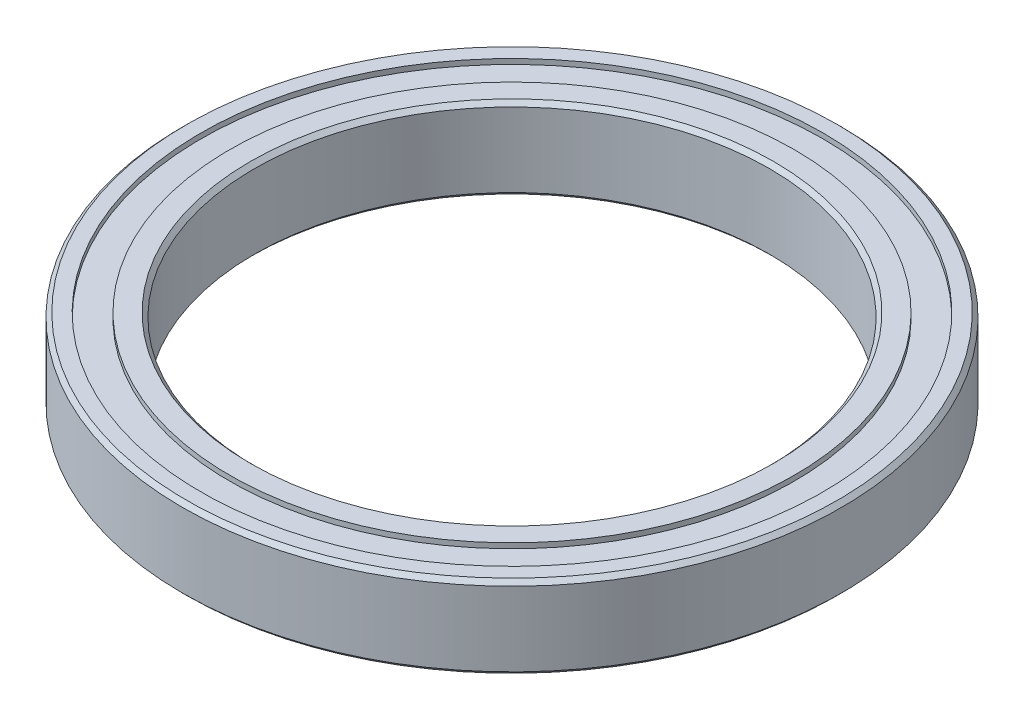
ISO-10303-21;
HEADER;
FILE_DESCRIPTION(('STEP AP214'),'2;1');
FILE_NAME('part.step','',(''),(''),'','','');
FILE_SCHEMA(('AUTOMOTIVE_DESIGN { 1 0 10303 214 1 1 1 1 }'));
ENDSEC;
DATA;
#1=APPLICATION_CONTEXT('core data for automotive mechanical design processes');
#2=APPLICATION_PROTOCOL_DEFINITION('international standard','automotive_design',2000,#1);
#3=PRODUCT_CONTEXT('',#1,'mechanical');
#4=PRODUCT('Part','Part','',(#3));
#5=PRODUCT_RELATED_PRODUCT_CATEGORY('part','',(#4));
#6=PRODUCT_DEFINITION_FORMATION('','',#4);
#7=PRODUCT_DEFINITION_CONTEXT('part definition',#1,'design');
#8=PRODUCT_DEFINITION('design','',#6,#7);
#9=PRODUCT_DEFINITION_SHAPE('','',#8);
#10=(LENGTH_UNIT() NAMED_UNIT(*) SI_UNIT(.MILLI.,.METRE.));
#11=(NAMED_UNIT(*) PLANE_ANGLE_UNIT() SI_UNIT($,.RADIAN.));
#12=(NAMED_UNIT(*) SI_UNIT($,.STERADIAN.) SOLID_ANGLE_UNIT());
#13=UNCERTAINTY_MEASURE_WITH_UNIT(LENGTH_MEASURE(1.E-05),#10,'distance_accuracy_value','');
#14=(GEOMETRIC_REPRESENTATION_CONTEXT(3) GLOBAL_UNCERTAINTY_ASSIGNED_CONTEXT((#13)) GLOBAL_UNIT_ASSIGNED_CONTEXT((#10,
#11,#12)) REPRESENTATION_CONTEXT('',''));
#15=CARTESIAN_POINT('',(0.,0.,0.));
#16=DIRECTION('',(0.,0.,1.));
#17=DIRECTION('',(1.,0.,0.));
#18=AXIS2_PLACEMENT_3D('',#15,#16,#17);
#19=CARTESIAN_POINT('',(0.,-2.,16.));
#20=DIRECTION('',(0.,1.,0.));
#21=DIRECTION('',(0.,0.,1.));
#22=AXIS2_PLACEMENT_3D('',#19,#20,#21);
#23=PLANE('',#22);
#24=CARTESIAN_POINT('',(0.,-2.,0.));
#25=DIRECTION('',(0.,1.,0.));
#26=DIRECTION('',(0.,0.,1.));
#27=AXIS2_PLACEMENT_3D('',#24,#25,#26);
#28=CIRCLE('',#27,15.8);
#29=CARTESIAN_POINT('',(0.,-2.,15.8));
#30=VERTEX_POINT('',#29);
#31=EDGE_CURVE('E10',#30,#30,#28,.F.);
#32=ORIENTED_EDGE('',*,*,#31,.T.);
#33=EDGE_LOOP('',(#32));
#34=FACE_BOUND('',#33,.T.);
#35=CARTESIAN_POINT('',(0.,-2.,0.));
#36=DIRECTION('',(0.,-1.,0.));
#37=DIRECTION('',(0.,0.,-1.));
#38=AXIS2_PLACEMENT_3D('',#35,#36,#37);
#39=CIRCLE('',#38,15.1);
#40=CARTESIAN_POINT('',(0.,-2.,-15.1));
#41=VERTEX_POINT('',#40);
#42=EDGE_CURVE('E69',#41,#41,#39,.T.);
#43=ORIENTED_EDGE('',*,*,#42,.F.);
#44=EDGE_LOOP('',(#43));
#45=FACE_BOUND('',#44,.T.);
#46=ADVANCED_FACE('F37',(#34,#45),#23,.F.);
#47=CARTESIAN_POINT('',(0.,-18.1229138650565,0.));
#48=DIRECTION('',(0.,-1.,0.));
#49=DIRECTION('',(0.,0.,-1.));
#50=AXIS2_PLACEMENT_3D('',#47,#48,#49);
#51=CYLINDRICAL_SURFACE('',#50,15.1);
#52=CARTESIAN_POINT('',(0.,-1.75,0.));
#53=DIRECTION('',(0.,-1.,0.));
#54=DIRECTION('',(0.,0.,-1.));
#55=AXIS2_PLACEMENT_3D('',#52,#53,#54);
#56=CIRCLE('',#55,15.1);
#57=CARTESIAN_POINT('',(0.,-1.75,-15.1));
#58=VERTEX_POINT('',#57);
#59=EDGE_CURVE('E72',#58,#58,#56,.T.);
#60=ORIENTED_EDGE('',*,*,#59,.F.);
#61=EDGE_LOOP('',(#60));
#62=FACE_BOUND('',#61,.T.);
#63=ORIENTED_EDGE('',*,*,#42,.T.);
#64=EDGE_LOOP('',(#63));
#65=FACE_BOUND('',#64,.T.);
#66=ADVANCED_FACE('F126',(#62,#65),#51,.F.);
#67=CARTESIAN_POINT('',(0.,-1.75,15.1));
#68=DIRECTION('',(0.,1.,0.));
#69=DIRECTION('',(0.,0.,1.));
#70=AXIS2_PLACEMENT_3D('',#67,#68,#69);
#71=PLANE('',#70);
#72=CARTESIAN_POINT('',(0.,-1.75,0.));
#73=DIRECTION('',(0.,-1.,0.));
#74=DIRECTION('',(0.,0.,-1.));
#75=AXIS2_PLACEMENT_3D('',#72,#73,#74);
#76=CIRCLE('',#75,13.7);
#77=CARTESIAN_POINT('',(0.,-1.75,-13.7));
#78=VERTEX_POINT('',#77);
#79=EDGE_CURVE('E75',#78,#78,#76,.T.);
#80=ORIENTED_EDGE('',*,*,#79,.F.);
#81=EDGE_LOOP('',(#80));
#82=FACE_BOUND('',#81,.T.);
#83=ORIENTED_EDGE('',*,*,#59,.T.);
#84=EDGE_LOOP('',(#83));
#85=FACE_BOUND('',#84,.T.);
#86=ADVANCED_FACE('F131',(#82,#85),#71,.F.);
#87=CARTESIAN_POINT('',(0.,-18.1229138650565,0.));
#88=DIRECTION('',(0.,-1.,0.));
#89=DIRECTION('',(0.,0.,-1.));
#90=AXIS2_PLACEMENT_3D('',#87,#88,#89);
#91=CYLINDRICAL_SURFACE('',#90,13.7);
#92=CARTESIAN_POINT('',(0.,-2.,0.));
#93=DIRECTION('',(0.,-1.,0.));
#94=DIRECTION('',(0.,0.,-1.));
#95=AXIS2_PLACEMENT_3D('',#92,#93,#94);
#96=CIRCLE('',#95,13.7);
#97=CARTESIAN_POINT('',(0.,-2.,-13.7));
#98=VERTEX_POINT('',#97);
#99=EDGE_CURVE('E78',#98,#98,#96,.T.);
#100=ORIENTED_EDGE('',*,*,#99,.F.);
#101=EDGE_LOOP('',(#100));
#102=FACE_BOUND('',#101,.T.);
#103=ORIENTED_EDGE('',*,*,#79,.T.);
#104=EDGE_LOOP('',(#103));
#105=FACE_BOUND('',#104,.T.);
#106=ADVANCED_FACE('F185',(#102,#105),#91,.T.);
#107=CARTESIAN_POINT('',(0.,-2.,13.7));
#108=DIRECTION('',(0.,1.,0.));
#109=DIRECTION('',(0.,0.,1.));
#110=AXIS2_PLACEMENT_3D('',#107,#108,#109);
#111=PLANE('',#110);
#112=CARTESIAN_POINT('',(0.,-2.,0.));
#113=DIRECTION('',(0.,1.,0.));
#114=DIRECTION('',(0.,0.,1.));
#115=AXIS2_PLACEMENT_3D('',#112,#113,#114);
#116=CIRCLE('',#115,12.7);
#117=CARTESIAN_POINT('',(0.,-2.,12.7));
#118=VERTEX_POINT('',#117);
#119=EDGE_CURVE('E57',#118,#118,#116,.T.);
#120=ORIENTED_EDGE('',*,*,#119,.T.);
#121=EDGE_LOOP('',(#120));
#122=FACE_BOUND('',#121,.T.);
#123=ORIENTED_EDGE('',*,*,#99,.T.);
#124=EDGE_LOOP('',(#123));
#125=FACE_BOUND('',#124,.T.);
#126=ADVANCED_FACE('F122',(#122,#125),#111,.F.);
#127=CARTESIAN_POINT('',(0.,-18.1229138650565,0.));
#128=DIRECTION('',(0.,-1.,0.));
#129=DIRECTION('',(0.,0.,-1.));
#130=AXIS2_PLACEMENT_3D('',#127,#128,#129);
#131=CYLINDRICAL_SURFACE('',#130,12.5);
#132=CARTESIAN_POINT('',(0.,1.8,0.));
#133=DIRECTION('',(0.,-1.,0.));
#134=DIRECTION('',(0.,0.,-1.));
#135=AXIS2_PLACEMENT_3D('',#132,#133,#134);
#136=CIRCLE('',#135,12.5);
#137=CARTESIAN_POINT('',(0.,1.8,-12.5));
#138=VERTEX_POINT('',#137);
#139=EDGE_CURVE('E60',#138,#138,#136,.F.);
#140=ORIENTED_EDGE('',*,*,#139,.T.);
#141=EDGE_LOOP('',(#140));
#142=FACE_BOUND('',#141,.T.);
#143=CARTESIAN_POINT('',(0.,-1.79999999999999,0.));
#144=DIRECTION('',(0.,1.,0.));
#145=DIRECTION('',(0.,0.,1.));
#146=AXIS2_PLACEMENT_3D('',#143,#144,#145);
#147=CIRCLE('',#146,12.5);
#148=CARTESIAN_POINT('',(0.,-1.79999999999999,12.5));
#149=VERTEX_POINT('',#148);
#150=EDGE_CURVE('E63',#149,#149,#147,.F.);
#151=ORIENTED_EDGE('',*,*,#150,.T.);
#152=EDGE_LOOP('',(#151));
#153=FACE_BOUND('',#152,.T.);
#154=ADVANCED_FACE('F116',(#142,#153),#131,.F.);
#155=CARTESIAN_POINT('',(0.,2.,13.7));
#156=DIRECTION('',(0.,-1.,0.));
#157=DIRECTION('',(0.,0.,-1.));
#158=AXIS2_PLACEMENT_3D('',#155,#156,#157);
#159=PLANE('',#158);
#160=CARTESIAN_POINT('',(0.,2.,0.));
#161=DIRECTION('',(0.,-1.,0.));
#162=DIRECTION('',(0.,0.,-1.));
#163=AXIS2_PLACEMENT_3D('',#160,#161,#162);
#164=CIRCLE('',#163,12.7);
#165=CARTESIAN_POINT('',(0.,2.,-12.7));
#166=VERTEX_POINT('',#165);
#167=EDGE_CURVE('E66',#166,#166,#164,.T.);
#168=ORIENTED_EDGE('',*,*,#167,.T.);
#169=EDGE_LOOP('',(#168));
#170=FACE_BOUND('',#169,.T.);
#171=CARTESIAN_POINT('',(0.,2.,0.));
#172=DIRECTION('',(0.,-1.,0.));
#173=DIRECTION('',(0.,0.,-1.));
#174=AXIS2_PLACEMENT_3D('',#171,#172,#173);
#175=CIRCLE('',#174,13.7);
#176=CARTESIAN_POINT('',(0.,2.,-13.7));
#177=VERTEX_POINT('',#176);
#178=EDGE_CURVE('E81',#177,#177,#175,.T.);
#179=ORIENTED_EDGE('',*,*,#178,.F.);
#180=EDGE_LOOP('',(#179));
#181=FACE_BOUND('',#180,.T.);
#182=ADVANCED_FACE('F111',(#170,#181),#159,.F.);
#183=CARTESIAN_POINT('',(0.,-18.1229138650565,0.));
#184=DIRECTION('',(0.,-1.,0.));
#185=DIRECTION('',(0.,0.,-1.));
#186=AXIS2_PLACEMENT_3D('',#183,#184,#185);
#187=CYLINDRICAL_SURFACE('',#186,13.7);
#188=CARTESIAN_POINT('',(0.,1.75,0.));
#189=DIRECTION('',(0.,-1.,0.));
#190=DIRECTION('',(0.,0.,-1.));
#191=AXIS2_PLACEMENT_3D('',#188,#189,#190);
#192=CIRCLE('',#191,13.7);
#193=CARTESIAN_POINT('',(0.,1.75,-13.7));
#194=VERTEX_POINT('',#193);
#195=EDGE_CURVE('E84',#194,#194,#192,.T.);
#196=ORIENTED_EDGE('',*,*,#195,.F.);
#197=EDGE_LOOP('',(#196));
#198=FACE_BOUND('',#197,.T.);
#199=ORIENTED_EDGE('',*,*,#178,.T.);
#200=EDGE_LOOP('',(#199));
#201=FACE_BOUND('',#200,.T.);
#202=ADVANCED_FACE('F105',(#198,#201),#187,.T.);
#203=CARTESIAN_POINT('',(0.,1.75,15.1));
#204=DIRECTION('',(0.,-1.,0.));
#205=DIRECTION('',(0.,0.,-1.));
#206=AXIS2_PLACEMENT_3D('',#203,#204,#205);
#207=PLANE('',#206);
#208=CARTESIAN_POINT('',(0.,1.75,0.));
#209=DIRECTION('',(0.,-1.,0.));
#210=DIRECTION('',(0.,0.,-1.));
#211=AXIS2_PLACEMENT_3D('',#208,#209,#210);
#212=CIRCLE('',#211,15.1);
#213=CARTESIAN_POINT('',(0.,1.75,-15.1));
#214=VERTEX_POINT('',#213);
#215=EDGE_CURVE('E87',#214,#214,#212,.T.);
#216=ORIENTED_EDGE('',*,*,#215,.F.);
#217=EDGE_LOOP('',(#216));
#218=FACE_BOUND('',#217,.T.);
#219=ORIENTED_EDGE('',*,*,#195,.T.);
#220=EDGE_LOOP('',(#219));
#221=FACE_BOUND('',#220,.T.);
#222=ADVANCED_FACE('F99',(#218,#221),#207,.F.);
#223=CARTESIAN_POINT('',(0.,-18.1229138650565,0.));
#224=DIRECTION('',(0.,-1.,0.));
#225=DIRECTION('',(0.,0.,-1.));
#226=AXIS2_PLACEMENT_3D('',#223,#224,#225);
#227=CYLINDRICAL_SURFACE('',#226,15.1);
#228=CARTESIAN_POINT('',(0.,2.,0.));
#229=DIRECTION('',(0.,-1.,0.));
#230=DIRECTION('',(0.,0.,-1.));
#231=AXIS2_PLACEMENT_3D('',#228,#229,#230);
#232=CIRCLE('',#231,15.1);
#233=CARTESIAN_POINT('',(0.,2.,-15.1));
#234=VERTEX_POINT('',#233);
#235=EDGE_CURVE('E90',#234,#234,#232,.T.);
#236=ORIENTED_EDGE('',*,*,#235,.F.);
#237=EDGE_LOOP('',(#236));
#238=FACE_BOUND('',#237,.T.);
#239=ORIENTED_EDGE('',*,*,#215,.T.);
#240=EDGE_LOOP('',(#239));
#241=FACE_BOUND('',#240,.T.);
#242=ADVANCED_FACE('F96',(#238,#241),#227,.F.);
#243=CARTESIAN_POINT('',(0.,2.,16.));
#244=DIRECTION('',(0.,-1.,0.));
#245=DIRECTION('',(0.,0.,-1.));
#246=AXIS2_PLACEMENT_3D('',#243,#244,#245);
#247=PLANE('',#246);
#248=CARTESIAN_POINT('',(0.,2.,0.));
#249=DIRECTION('',(0.,-1.,0.));
#250=DIRECTION('',(0.,0.,-1.));
#251=AXIS2_PLACEMENT_3D('',#248,#249,#250);
#252=CIRCLE('',#251,15.8);
#253=CARTESIAN_POINT('',(0.,2.,-15.8));
#254=VERTEX_POINT('',#253);
#255=EDGE_CURVE('E44',#254,#254,#252,.F.);
#256=ORIENTED_EDGE('',*,*,#255,.T.);
#257=EDGE_LOOP('',(#256));
#258=FACE_BOUND('',#257,.T.);
#259=ORIENTED_EDGE('',*,*,#235,.T.);
#260=EDGE_LOOP('',(#259));
#261=FACE_BOUND('',#260,.T.);
#262=ADVANCED_FACE('F94',(#258,#261),#247,.F.);
#263=CARTESIAN_POINT('',(0.,-18.1229138650565,0.));
#264=DIRECTION('',(0.,-1.,0.));
#265=DIRECTION('',(0.,0.,-1.));
#266=AXIS2_PLACEMENT_3D('',#263,#264,#265);
#267=CYLINDRICAL_SURFACE('',#266,16.);
#268=CARTESIAN_POINT('',(0.,1.80000000000001,0.));
#269=DIRECTION('',(0.,-1.,0.));
#270=DIRECTION('',(0.,0.,-1.));
#271=AXIS2_PLACEMENT_3D('',#268,#269,#270);
#272=CIRCLE('',#271,16.);
#273=CARTESIAN_POINT('',(0.,1.80000000000001,-16.));
#274=VERTEX_POINT('',#273);
#275=EDGE_CURVE('E48',#274,#274,#272,.T.);
#276=ORIENTED_EDGE('',*,*,#275,.T.);
#277=EDGE_LOOP('',(#276));
#278=FACE_BOUND('',#277,.T.);
#279=CARTESIAN_POINT('',(0.,-1.80000000000002,0.));
#280=DIRECTION('',(0.,1.,0.));
#281=DIRECTION('',(0.,0.,1.));
#282=AXIS2_PLACEMENT_3D('',#279,#280,#281);
#283=CIRCLE('',#282,16.);
#284=CARTESIAN_POINT('',(0.,-1.80000000000002,16.));
#285=VERTEX_POINT('',#284);
#286=EDGE_CURVE('E52',#285,#285,#283,.T.);
#287=ORIENTED_EDGE('',*,*,#286,.T.);
#288=EDGE_LOOP('',(#287));
#289=FACE_BOUND('',#288,.T.);
#290=ADVANCED_FACE('F141',(#278,#289),#267,.T.);
#291=CARTESIAN_POINT('',(0.,2.,0.));
#292=DIRECTION('',(0.,1.,0.));
#293=DIRECTION('',(0.,0.,1.));
#294=AXIS2_PLACEMENT_3D('',#291,#292,#293);
#295=CONICAL_SURFACE('',#294,12.7,0.785398163397448);
#296=ORIENTED_EDGE('',*,*,#139,.F.);
#297=EDGE_LOOP('',(#296));
#298=FACE_BOUND('',#297,.T.);
#299=ORIENTED_EDGE('',*,*,#167,.F.);
#300=EDGE_LOOP('',(#299));
#301=FACE_BOUND('',#300,.T.);
#302=ADVANCED_FACE('F137',(#298,#301),#295,.F.);
#303=CARTESIAN_POINT('',(0.,-1.79999999999999,0.));
#304=DIRECTION('',(0.,-1.,0.));
#305=DIRECTION('',(0.,0.,-1.));
#306=AXIS2_PLACEMENT_3D('',#303,#304,#305);
#307=CONICAL_SURFACE('',#306,12.5,0.785398163397453);
#308=ORIENTED_EDGE('',*,*,#119,.F.);
#309=EDGE_LOOP('',(#308));
#310=FACE_BOUND('',#309,.T.);
#311=ORIENTED_EDGE('',*,*,#150,.F.);
#312=EDGE_LOOP('',(#311));
#313=FACE_BOUND('',#312,.T.);
#314=ADVANCED_FACE('F140',(#310,#313),#307,.F.);
#315=CARTESIAN_POINT('',(0.,1.80000000000001,0.));
#316=DIRECTION('',(0.,-1.,0.));
#317=DIRECTION('',(0.,0.,-1.));
#318=AXIS2_PLACEMENT_3D('',#315,#316,#317);
#319=CONICAL_SURFACE('',#318,16.,0.785398163397448);
#320=ORIENTED_EDGE('',*,*,#255,.F.);
#321=EDGE_LOOP('',(#320));
#322=FACE_BOUND('',#321,.T.);
#323=ORIENTED_EDGE('',*,*,#275,.F.);
#324=EDGE_LOOP('',(#323));
#325=FACE_BOUND('',#324,.T.);
#326=ADVANCED_FACE('F144',(#322,#325),#319,.T.);
#327=CARTESIAN_POINT('',(0.,-2.,0.));
#328=DIRECTION('',(0.,1.,0.));
#329=DIRECTION('',(0.,0.,1.));
#330=AXIS2_PLACEMENT_3D('',#327,#328,#329);
#331=CONICAL_SURFACE('',#330,15.8,0.785398163397466);
#332=ORIENTED_EDGE('',*,*,#286,.F.);
#333=EDGE_LOOP('',(#332));
#334=FACE_BOUND('',#333,.T.);
#335=ORIENTED_EDGE('',*,*,#31,.F.);
#336=EDGE_LOOP('',(#335));
#337=FACE_BOUND('',#336,.T.);
#338=ADVANCED_FACE('F39',(#334,#337),#331,.T.);
#339=CLOSED_SHELL('',(#46,#66,#86,#106,#126,#154,#182,#202,#222,#242,#262,#290,#302,#314,#326,#338));
#340=MANIFOLD_SOLID_BREP('B2',#339);
#341=ADVANCED_BREP_SHAPE_REPRESENTATION('',(#18,#340),#14);
#342=SHAPE_DEFINITION_REPRESENTATION(#9,#341);
ENDSEC;
END-ISO-10303-21;
